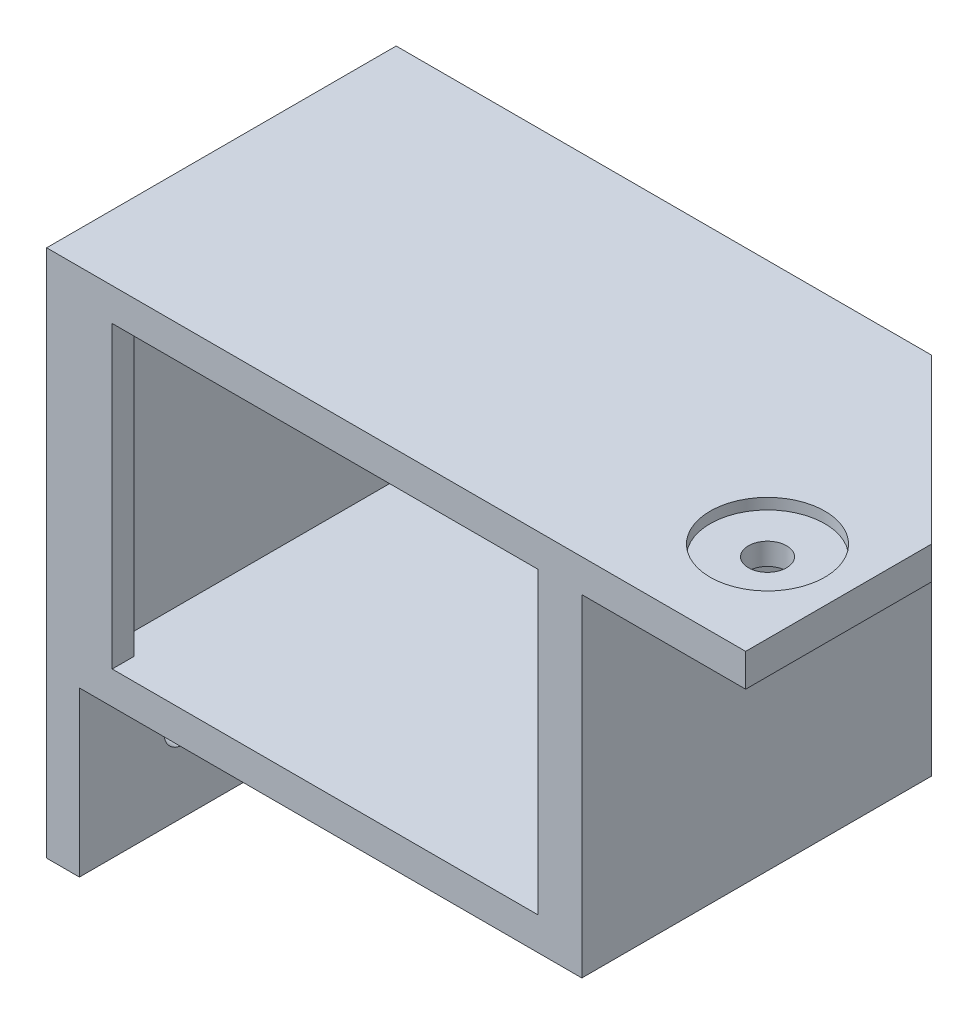
ISO-10303-21;
HEADER;
FILE_DESCRIPTION(('STEP AP214'),'2;1');
FILE_NAME('part.step','',(''),(''),'','','');
FILE_SCHEMA(('AUTOMOTIVE_DESIGN { 1 0 10303 214 1 1 1 1 }'));
ENDSEC;
DATA;
#1=APPLICATION_CONTEXT('core data for automotive mechanical design processes');
#2=APPLICATION_PROTOCOL_DEFINITION('international standard','automotive_design',2000,#1);
#3=PRODUCT_CONTEXT('',#1,'mechanical');
#4=PRODUCT('Part','Part','',(#3));
#5=PRODUCT_RELATED_PRODUCT_CATEGORY('part','',(#4));
#6=PRODUCT_DEFINITION_FORMATION('','',#4);
#7=PRODUCT_DEFINITION_CONTEXT('part definition',#1,'design');
#8=PRODUCT_DEFINITION('design','',#6,#7);
#9=PRODUCT_DEFINITION_SHAPE('','',#8);
#10=(LENGTH_UNIT() NAMED_UNIT(*) SI_UNIT(.MILLI.,.METRE.));
#11=(NAMED_UNIT(*) PLANE_ANGLE_UNIT() SI_UNIT($,.RADIAN.));
#12=(NAMED_UNIT(*) SI_UNIT($,.STERADIAN.) SOLID_ANGLE_UNIT());
#13=UNCERTAINTY_MEASURE_WITH_UNIT(LENGTH_MEASURE(1.E-05),#10,'distance_accuracy_value','');
#14=(GEOMETRIC_REPRESENTATION_CONTEXT(3) GLOBAL_UNCERTAINTY_ASSIGNED_CONTEXT((#13)) GLOBAL_UNIT_ASSIGNED_CONTEXT((#10,
#11,#12)) REPRESENTATION_CONTEXT('',''));
#15=CARTESIAN_POINT('',(0.,0.,0.));
#16=DIRECTION('',(0.,0.,1.));
#17=DIRECTION('',(1.,0.,0.));
#18=AXIS2_PLACEMENT_3D('',#15,#16,#17);
#19=CARTESIAN_POINT('',(-3.,-40.9000000000001,22.5));
#20=DIRECTION('',(1.,0.,0.));
#21=DIRECTION('',(0.,1.,0.));
#22=AXIS2_PLACEMENT_3D('',#19,#20,#21);
#23=CYLINDRICAL_SURFACE('',#22,1.75);
#24=CARTESIAN_POINT('',(3.,-40.9000000000001,22.5));
#25=DIRECTION('',(1.,0.,0.));
#26=DIRECTION('',(0.,1.,0.));
#27=AXIS2_PLACEMENT_3D('',#24,#25,#26);
#28=CIRCLE('',#27,1.75);
#29=CARTESIAN_POINT('',(3.,-39.1500000000001,22.5));
#30=VERTEX_POINT('',#29);
#31=EDGE_CURVE('E187',#30,#30,#28,.T.);
#32=ORIENTED_EDGE('',*,*,#31,.T.);
#33=EDGE_LOOP('',(#32));
#34=FACE_BOUND('',#33,.T.);
#35=CARTESIAN_POINT('',(1.,-40.9000000000001,22.5));
#36=DIRECTION('',(-1.,0.,0.));
#37=DIRECTION('',(0.,-1.,0.));
#38=AXIS2_PLACEMENT_3D('',#35,#36,#37);
#39=CIRCLE('',#38,1.75);
#40=CARTESIAN_POINT('',(1.,-42.6500000000001,22.5));
#41=VERTEX_POINT('',#40);
#42=EDGE_CURVE('E39',#41,#41,#39,.F.);
#43=ORIENTED_EDGE('',*,*,#42,.F.);
#44=EDGE_LOOP('',(#43));
#45=FACE_BOUND('',#44,.T.);
#46=ADVANCED_FACE('F35',(#34,#45),#23,.F.);
#47=CARTESIAN_POINT('',(56.5,2.99999999999996,22.5));
#48=DIRECTION('',(0.,-1.,0.));
#49=DIRECTION('',(1.,0.,0.));
#50=AXIS2_PLACEMENT_3D('',#47,#48,#49);
#51=CYLINDRICAL_SURFACE('',#50,1.75);
#52=CARTESIAN_POINT('',(56.5,-3.00000000000004,22.5));
#53=DIRECTION('',(0.,-1.,0.));
#54=DIRECTION('',(1.,0.,0.));
#55=AXIS2_PLACEMENT_3D('',#52,#53,#54);
#56=CIRCLE('',#55,1.75);
#57=CARTESIAN_POINT('',(58.25,-3.00000000000004,22.5));
#58=VERTEX_POINT('',#57);
#59=EDGE_CURVE('E183',#58,#58,#56,.T.);
#60=ORIENTED_EDGE('',*,*,#59,.T.);
#61=EDGE_LOOP('',(#60));
#62=FACE_BOUND('',#61,.T.);
#63=CARTESIAN_POINT('',(56.5,-1.,22.5));
#64=DIRECTION('',(0.,1.,0.));
#65=DIRECTION('',(0.,0.,1.));
#66=AXIS2_PLACEMENT_3D('',#63,#64,#65);
#67=CIRCLE('',#66,1.75);
#68=CARTESIAN_POINT('',(56.5,-1.,24.25));
#69=VERTEX_POINT('',#68);
#70=EDGE_CURVE('E290',#69,#69,#67,.F.);
#71=ORIENTED_EDGE('',*,*,#70,.F.);
#72=EDGE_LOOP('',(#71));
#73=FACE_BOUND('',#72,.T.);
#74=ADVANCED_FACE('F348',(#62,#73),#51,.F.);
#75=CARTESIAN_POINT('',(5.99999999999999,-3.00000000000005,32.));
#76=DIRECTION('',(1.,0.,0.));
#77=DIRECTION('',(0.,1.,0.));
#78=AXIS2_PLACEMENT_3D('',#75,#76,#77);
#79=PLANE('',#78);
#80=DIRECTION('',(0.,0.,-1.));
#81=VECTOR('',#80,1.);
#82=CARTESIAN_POINT('',(6.,-30.4,32.));
#83=LINE('',#82,#81);
#84=CARTESIAN_POINT('',(6.,-30.4,32.));
#85=VERTEX_POINT('',#84);
#86=CARTESIAN_POINT('',(6.,-30.4,30.));
#87=VERTEX_POINT('',#86);
#88=EDGE_CURVE('E225',#85,#87,#83,.T.);
#89=ORIENTED_EDGE('',*,*,#88,.T.);
#90=DIRECTION('',(0.,1.,0.));
#91=VECTOR('',#90,1.);
#92=CARTESIAN_POINT('',(5.99999999999999,-3.00000000000005,30.));
#93=LINE('',#92,#91);
#94=CARTESIAN_POINT('',(5.99999999999999,-3.00000000000005,30.));
#95=VERTEX_POINT('',#94);
#96=EDGE_CURVE('E168',#87,#95,#93,.T.);
#97=ORIENTED_EDGE('',*,*,#96,.T.);
#98=DIRECTION('',(0.,0.,-1.));
#99=VECTOR('',#98,1.);
#100=CARTESIAN_POINT('',(5.99999999999999,-3.00000000000005,32.));
#101=LINE('',#100,#99);
#102=CARTESIAN_POINT('',(5.99999999999999,-3.00000000000005,32.));
#103=VERTEX_POINT('',#102);
#104=EDGE_CURVE('E215',#103,#95,#101,.T.);
#105=ORIENTED_EDGE('',*,*,#104,.F.);
#106=DIRECTION('',(0.,-1.,0.));
#107=VECTOR('',#106,1.);
#108=CARTESIAN_POINT('',(5.99999999999999,-3.00000000000005,32.));
#109=LINE('',#108,#107);
#110=EDGE_CURVE('E207',#103,#85,#109,.T.);
#111=ORIENTED_EDGE('',*,*,#110,.T.);
#112=EDGE_LOOP('',(#89,#97,#105,#111));
#113=FACE_BOUND('',#112,.T.);
#114=ADVANCED_FACE('F325',(#113),#79,.T.);
#115=CARTESIAN_POINT('',(45.,-3.00000000000004,32.));
#116=DIRECTION('',(-1.,0.,0.));
#117=DIRECTION('',(0.,-1.,0.));
#118=AXIS2_PLACEMENT_3D('',#115,#116,#117);
#119=PLANE('',#118);
#120=DIRECTION('',(0.,0.,-1.));
#121=VECTOR('',#120,1.);
#122=CARTESIAN_POINT('',(45.,-3.00000000000004,32.));
#123=LINE('',#122,#121);
#124=CARTESIAN_POINT('',(45.,-3.00000000000004,32.));
#125=VERTEX_POINT('',#124);
#126=CARTESIAN_POINT('',(45.,-3.00000000000004,30.));
#127=VERTEX_POINT('',#126);
#128=EDGE_CURVE('E220',#125,#127,#123,.T.);
#129=ORIENTED_EDGE('',*,*,#128,.T.);
#130=DIRECTION('',(0.,-1.,0.));
#131=VECTOR('',#130,1.);
#132=CARTESIAN_POINT('',(45.,-3.00000000000004,30.));
#133=LINE('',#132,#131);
#134=CARTESIAN_POINT('',(45.,-30.4,30.));
#135=VERTEX_POINT('',#134);
#136=EDGE_CURVE('E202',#127,#135,#133,.T.);
#137=ORIENTED_EDGE('',*,*,#136,.T.);
#138=DIRECTION('',(0.,0.,-1.));
#139=VECTOR('',#138,1.);
#140=CARTESIAN_POINT('',(45.,-30.4,32.));
#141=LINE('',#140,#139);
#142=CARTESIAN_POINT('',(45.,-30.4,32.));
#143=VERTEX_POINT('',#142);
#144=EDGE_CURVE('E223',#143,#135,#141,.T.);
#145=ORIENTED_EDGE('',*,*,#144,.F.);
#146=DIRECTION('',(0.,1.,0.));
#147=VECTOR('',#146,1.);
#148=CARTESIAN_POINT('',(45.,-3.00000000000004,32.));
#149=LINE('',#148,#147);
#150=EDGE_CURVE('E211',#143,#125,#149,.T.);
#151=ORIENTED_EDGE('',*,*,#150,.T.);
#152=EDGE_LOOP('',(#129,#137,#145,#151));
#153=FACE_BOUND('',#152,.T.);
#154=ADVANCED_FACE('F333',(#153),#119,.T.);
#155=CARTESIAN_POINT('',(0.,0.,32.));
#156=DIRECTION('',(0.,0.,-1.));
#157=DIRECTION('',(-1.,0.,0.));
#158=AXIS2_PLACEMENT_3D('',#155,#156,#157);
#159=PLANE('',#158);
#160=DIRECTION('',(0.,-1.,0.));
#161=VECTOR('',#160,1.);
#162=CARTESIAN_POINT('',(0.,-48.4000000000001,32.));
#163=LINE('',#162,#161);
#164=CARTESIAN_POINT('',(0.,0.,32.));
#165=VERTEX_POINT('',#164);
#166=CARTESIAN_POINT('',(0.,-48.4000000000001,32.));
#167=VERTEX_POINT('',#166);
#168=EDGE_CURVE('E229',#165,#167,#163,.T.);
#169=ORIENTED_EDGE('',*,*,#168,.T.);
#170=DIRECTION('',(1.,0.,0.));
#171=VECTOR('',#170,1.);
#172=CARTESIAN_POINT('',(3.00000000000001,-48.4000000000001,32.));
#173=LINE('',#172,#171);
#174=CARTESIAN_POINT('',(3.00000000000001,-48.4000000000001,32.));
#175=VERTEX_POINT('',#174);
#176=EDGE_CURVE('E232',#167,#175,#173,.T.);
#177=ORIENTED_EDGE('',*,*,#176,.T.);
#178=DIRECTION('',(0.,1.,0.));
#179=VECTOR('',#178,1.);
#180=CARTESIAN_POINT('',(3.,-33.4000000000001,32.));
#181=LINE('',#180,#179);
#182=CARTESIAN_POINT('',(3.,-33.4000000000001,32.));
#183=VERTEX_POINT('',#182);
#184=EDGE_CURVE('E235',#175,#183,#181,.T.);
#185=ORIENTED_EDGE('',*,*,#184,.T.);
#186=DIRECTION('',(1.,0.,0.));
#187=VECTOR('',#186,1.);
#188=CARTESIAN_POINT('',(49.,-33.4,32.));
#189=LINE('',#188,#187);
#190=CARTESIAN_POINT('',(49.,-33.4,32.));
#191=VERTEX_POINT('',#190);
#192=EDGE_CURVE('E237',#183,#191,#189,.T.);
#193=ORIENTED_EDGE('',*,*,#192,.T.);
#194=DIRECTION('',(0.,1.,0.));
#195=VECTOR('',#194,1.);
#196=CARTESIAN_POINT('',(49.,-3.00000000000004,32.));
#197=LINE('',#196,#195);
#198=CARTESIAN_POINT('',(49.,-3.00000000000004,32.));
#199=VERTEX_POINT('',#198);
#200=EDGE_CURVE('E239',#191,#199,#197,.T.);
#201=ORIENTED_EDGE('',*,*,#200,.T.);
#202=DIRECTION('',(1.,0.,0.));
#203=VECTOR('',#202,1.);
#204=CARTESIAN_POINT('',(64.,-3.00000000000003,32.));
#205=LINE('',#204,#203);
#206=CARTESIAN_POINT('',(64.,-3.00000000000003,32.));
#207=VERTEX_POINT('',#206);
#208=EDGE_CURVE('E241',#199,#207,#205,.T.);
#209=ORIENTED_EDGE('',*,*,#208,.T.);
#210=DIRECTION('',(0.,1.,0.));
#211=VECTOR('',#210,1.);
#212=CARTESIAN_POINT('',(64.,0.,32.));
#213=LINE('',#212,#211);
#214=CARTESIAN_POINT('',(64.,0.,32.));
#215=VERTEX_POINT('',#214);
#216=EDGE_CURVE('E243',#207,#215,#213,.T.);
#217=ORIENTED_EDGE('',*,*,#216,.T.);
#218=DIRECTION('',(-1.,0.,0.));
#219=VECTOR('',#218,1.);
#220=CARTESIAN_POINT('',(0.,0.,32.));
#221=LINE('',#220,#219);
#222=EDGE_CURVE('E245',#215,#165,#221,.T.);
#223=ORIENTED_EDGE('',*,*,#222,.T.);
#224=EDGE_LOOP('',(#169,#177,#185,#193,#201,#209,#217,#223));
#225=FACE_BOUND('',#224,.T.);
#226=ORIENTED_EDGE('',*,*,#110,.F.);
#227=DIRECTION('',(-1.,0.,0.));
#228=VECTOR('',#227,1.);
#229=CARTESIAN_POINT('',(5.99999999999999,-3.00000000000005,32.));
#230=LINE('',#229,#228);
#231=EDGE_CURVE('E214',#125,#103,#230,.T.);
#232=ORIENTED_EDGE('',*,*,#231,.F.);
#233=ORIENTED_EDGE('',*,*,#150,.F.);
#234=DIRECTION('',(1.,0.,0.));
#235=VECTOR('',#234,1.);
#236=CARTESIAN_POINT('',(6.,-30.4,32.));
#237=LINE('',#236,#235);
#238=EDGE_CURVE('E209',#85,#143,#237,.T.);
#239=ORIENTED_EDGE('',*,*,#238,.F.);
#240=EDGE_LOOP('',(#226,#232,#233,#239));
#241=FACE_BOUND('',#240,.T.);
#242=ADVANCED_FACE('F329',(#225,#241),#159,.F.);
#243=CARTESIAN_POINT('',(0.,0.,0.));
#244=DIRECTION('',(0.,0.,-1.));
#245=DIRECTION('',(-1.,0.,0.));
#246=AXIS2_PLACEMENT_3D('',#243,#244,#245);
#247=PLANE('',#246);
#248=DIRECTION('',(0.,-1.,0.));
#249=VECTOR('',#248,1.);
#250=CARTESIAN_POINT('',(47.,-3.00000000000004,0.));
#251=LINE('',#250,#249);
#252=CARTESIAN_POINT('',(47.,-3.00000000000004,0.));
#253=VERTEX_POINT('',#252);
#254=CARTESIAN_POINT('',(47.,-30.4,0.));
#255=VERTEX_POINT('',#254);
#256=EDGE_CURVE('E161',#253,#255,#251,.T.);
#257=ORIENTED_EDGE('',*,*,#256,.F.);
#258=DIRECTION('',(-1.,0.,0.));
#259=VECTOR('',#258,1.);
#260=CARTESIAN_POINT('',(5.99999999999999,-3.00000000000005,0.));
#261=LINE('',#260,#259);
#262=CARTESIAN_POINT('',(4.,-3.00000000000004,0.));
#263=VERTEX_POINT('',#262);
#264=EDGE_CURVE('E167',#253,#263,#261,.T.);
#265=ORIENTED_EDGE('',*,*,#264,.T.);
#266=DIRECTION('',(0.,1.,0.));
#267=VECTOR('',#266,1.);
#268=CARTESIAN_POINT('',(4.,-3.00000000000004,0.));
#269=LINE('',#268,#267);
#270=CARTESIAN_POINT('',(4.,-30.4,0.));
#271=VERTEX_POINT('',#270);
#272=EDGE_CURVE('E163',#271,#263,#269,.T.);
#273=ORIENTED_EDGE('',*,*,#272,.F.);
#274=DIRECTION('',(1.,0.,0.));
#275=VECTOR('',#274,1.);
#276=CARTESIAN_POINT('',(6.,-30.4,0.));
#277=LINE('',#276,#275);
#278=EDGE_CURVE('E156',#271,#255,#277,.T.);
#279=ORIENTED_EDGE('',*,*,#278,.T.);
#280=EDGE_LOOP('',(#257,#265,#273,#279));
#281=FACE_BOUND('',#280,.T.);
#282=DIRECTION('',(1.,0.,0.));
#283=VECTOR('',#282,1.);
#284=CARTESIAN_POINT('',(49.,-33.4,0.));
#285=LINE('',#284,#283);
#286=CARTESIAN_POINT('',(3.,-33.4000000000001,0.));
#287=VERTEX_POINT('',#286);
#288=CARTESIAN_POINT('',(49.,-33.4,0.));
#289=VERTEX_POINT('',#288);
#290=EDGE_CURVE('E250',#287,#289,#285,.T.);
#291=ORIENTED_EDGE('',*,*,#290,.F.);
#292=DIRECTION('',(-1.,0.,0.));
#293=VECTOR('',#292,1.);
#294=CARTESIAN_POINT('',(0.,-33.4,0.));
#295=LINE('',#294,#293);
#296=CARTESIAN_POINT('',(0.,-33.4,0.));
#297=VERTEX_POINT('',#296);
#298=EDGE_CURVE('E284',#287,#297,#295,.T.);
#299=ORIENTED_EDGE('',*,*,#298,.T.);
#300=DIRECTION('',(0.,-1.,0.));
#301=VECTOR('',#300,1.);
#302=CARTESIAN_POINT('',(0.,-48.4000000000001,0.));
#303=LINE('',#302,#301);
#304=CARTESIAN_POINT('',(0.,0.,0.));
#305=VERTEX_POINT('',#304);
#306=EDGE_CURVE('E228',#305,#297,#303,.T.);
#307=ORIENTED_EDGE('',*,*,#306,.F.);
#308=DIRECTION('',(-1.,0.,0.));
#309=VECTOR('',#308,1.);
#310=CARTESIAN_POINT('',(0.,0.,0.));
#311=LINE('',#310,#309);
#312=CARTESIAN_POINT('',(48.9999999999999,0.,0.));
#313=VERTEX_POINT('',#312);
#314=EDGE_CURVE('E233',#313,#305,#311,.T.);
#315=ORIENTED_EDGE('',*,*,#314,.F.);
#316=DIRECTION('',(0.,-1.,0.));
#317=VECTOR('',#316,1.);
#318=CARTESIAN_POINT('',(48.9999999999999,-3.00000000000003,0.));
#319=LINE('',#318,#317);
#320=CARTESIAN_POINT('',(49.,-3.00000000000004,0.));
#321=VERTEX_POINT('',#320);
#322=EDGE_CURVE('E282',#313,#321,#319,.T.);
#323=ORIENTED_EDGE('',*,*,#322,.T.);
#324=DIRECTION('',(0.,1.,0.));
#325=VECTOR('',#324,1.);
#326=CARTESIAN_POINT('',(49.,-3.00000000000004,0.));
#327=LINE('',#326,#325);
#328=EDGE_CURVE('E252',#289,#321,#327,.T.);
#329=ORIENTED_EDGE('',*,*,#328,.F.);
#330=EDGE_LOOP('',(#291,#299,#307,#315,#323,#329));
#331=FACE_BOUND('',#330,.T.);
#332=ADVANCED_FACE('F158',(#281,#331),#247,.T.);
#333=CARTESIAN_POINT('',(0.,-48.4000000000001,32.));
#334=DIRECTION('',(1.,0.,0.));
#335=DIRECTION('',(0.,1.,0.));
#336=AXIS2_PLACEMENT_3D('',#333,#334,#335);
#337=PLANE('',#336);
#338=CARTESIAN_POINT('',(0.,-40.9000000000001,22.5));
#339=DIRECTION('',(-1.,0.,0.));
#340=DIRECTION('',(0.,-1.,0.));
#341=AXIS2_PLACEMENT_3D('',#338,#339,#340);
#342=CIRCLE('',#341,5.25);
#343=CARTESIAN_POINT('',(0.,-46.1500000000001,22.5));
#344=VERTEX_POINT('',#343);
#345=EDGE_CURVE('E305',#344,#344,#342,.T.);
#346=ORIENTED_EDGE('',*,*,#345,.F.);
#347=EDGE_LOOP('',(#346));
#348=FACE_BOUND('',#347,.T.);
#349=ORIENTED_EDGE('',*,*,#306,.T.);
#350=DIRECTION('',(0.,-0.707106781186548,0.707106781186547));
#351=VECTOR('',#350,1.);
#352=CARTESIAN_POINT('',(0.,-48.4000000000001,15.));
#353=LINE('',#352,#351);
#354=CARTESIAN_POINT('',(0.,-48.4000000000001,15.));
#355=VERTEX_POINT('',#354);
#356=EDGE_CURVE('E286',#297,#355,#353,.T.);
#357=ORIENTED_EDGE('',*,*,#356,.T.);
#358=DIRECTION('',(0.,0.,-1.));
#359=VECTOR('',#358,1.);
#360=CARTESIAN_POINT('',(0.,-48.4000000000001,32.));
#361=LINE('',#360,#359);
#362=EDGE_CURVE('E274',#167,#355,#361,.T.);
#363=ORIENTED_EDGE('',*,*,#362,.F.);
#364=ORIENTED_EDGE('',*,*,#168,.F.);
#365=DIRECTION('',(0.,0.,-1.));
#366=VECTOR('',#365,1.);
#367=CARTESIAN_POINT('',(0.,0.,32.));
#368=LINE('',#367,#366);
#369=EDGE_CURVE('E247',#165,#305,#368,.T.);
#370=ORIENTED_EDGE('',*,*,#369,.T.);
#371=EDGE_LOOP('',(#349,#357,#363,#364,#370));
#372=FACE_BOUND('',#371,.T.);
#373=ADVANCED_FACE('F383',(#348,#372),#337,.F.);
#374=CARTESIAN_POINT('',(3.00000000000001,-48.4000000000001,32.));
#375=DIRECTION('',(0.,1.,0.));
#376=DIRECTION('',(0.,0.,1.));
#377=AXIS2_PLACEMENT_3D('',#374,#375,#376);
#378=PLANE('',#377);
#379=ORIENTED_EDGE('',*,*,#362,.T.);
#380=DIRECTION('',(1.,0.,0.));
#381=VECTOR('',#380,1.);
#382=CARTESIAN_POINT('',(3.00000000000001,-48.4000000000001,15.));
#383=LINE('',#382,#381);
#384=CARTESIAN_POINT('',(3.00000000000001,-48.4000000000001,15.));
#385=VERTEX_POINT('',#384);
#386=EDGE_CURVE('E277',#355,#385,#383,.T.);
#387=ORIENTED_EDGE('',*,*,#386,.T.);
#388=DIRECTION('',(0.,0.,-1.));
#389=VECTOR('',#388,1.);
#390=CARTESIAN_POINT('',(3.00000000000001,-48.4000000000001,32.));
#391=LINE('',#390,#389);
#392=EDGE_CURVE('E271',#175,#385,#391,.T.);
#393=ORIENTED_EDGE('',*,*,#392,.F.);
#394=ORIENTED_EDGE('',*,*,#176,.F.);
#395=EDGE_LOOP('',(#379,#387,#393,#394));
#396=FACE_BOUND('',#395,.T.);
#397=ADVANCED_FACE('F386',(#396),#378,.F.);
#398=CARTESIAN_POINT('',(3.,-33.4000000000001,32.));
#399=DIRECTION('',(-1.,0.,0.));
#400=DIRECTION('',(0.,-1.,0.));
#401=AXIS2_PLACEMENT_3D('',#398,#399,#400);
#402=PLANE('',#401);
#403=ORIENTED_EDGE('',*,*,#31,.F.);
#404=EDGE_LOOP('',(#403));
#405=FACE_BOUND('',#404,.T.);
#406=ORIENTED_EDGE('',*,*,#392,.T.);
#407=DIRECTION('',(0.,0.707106781186548,-0.707106781186547));
#408=VECTOR('',#407,1.);
#409=CARTESIAN_POINT('',(3.00000000000001,-48.4000000000001,15.));
#410=LINE('',#409,#408);
#411=EDGE_CURVE('E280',#385,#287,#410,.T.);
#412=ORIENTED_EDGE('',*,*,#411,.T.);
#413=DIRECTION('',(0.,0.,-1.));
#414=VECTOR('',#413,1.);
#415=CARTESIAN_POINT('',(3.,-33.4000000000001,32.));
#416=LINE('',#415,#414);
#417=EDGE_CURVE('E268',#183,#287,#416,.T.);
#418=ORIENTED_EDGE('',*,*,#417,.F.);
#419=ORIENTED_EDGE('',*,*,#184,.F.);
#420=EDGE_LOOP('',(#406,#412,#418,#419));
#421=FACE_BOUND('',#420,.T.);
#422=ADVANCED_FACE('F402',(#405,#421),#402,.F.);
#423=CARTESIAN_POINT('',(49.,-33.4,32.));
#424=DIRECTION('',(0.,1.,0.));
#425=DIRECTION('',(-1.,0.,0.));
#426=AXIS2_PLACEMENT_3D('',#423,#424,#425);
#427=PLANE('',#426);
#428=ORIENTED_EDGE('',*,*,#290,.T.);
#429=DIRECTION('',(0.,0.,-1.));
#430=VECTOR('',#429,1.);
#431=CARTESIAN_POINT('',(49.,-33.4,32.));
#432=LINE('',#431,#430);
#433=EDGE_CURVE('E265',#191,#289,#432,.T.);
#434=ORIENTED_EDGE('',*,*,#433,.F.);
#435=ORIENTED_EDGE('',*,*,#192,.F.);
#436=ORIENTED_EDGE('',*,*,#417,.T.);
#437=EDGE_LOOP('',(#428,#434,#435,#436));
#438=FACE_BOUND('',#437,.T.);
#439=ADVANCED_FACE('F423',(#438),#427,.F.);
#440=CARTESIAN_POINT('',(49.,-3.00000000000004,32.));
#441=DIRECTION('',(-1.,0.,0.));
#442=DIRECTION('',(0.,-1.,0.));
#443=AXIS2_PLACEMENT_3D('',#440,#441,#442);
#444=PLANE('',#443);
#445=ORIENTED_EDGE('',*,*,#328,.T.);
#446=DIRECTION('',(0.,0.,-1.));
#447=VECTOR('',#446,1.);
#448=CARTESIAN_POINT('',(49.,-3.00000000000004,32.));
#449=LINE('',#448,#447);
#450=EDGE_CURVE('E263',#199,#321,#449,.T.);
#451=ORIENTED_EDGE('',*,*,#450,.F.);
#452=ORIENTED_EDGE('',*,*,#200,.F.);
#453=ORIENTED_EDGE('',*,*,#433,.T.);
#454=EDGE_LOOP('',(#445,#451,#452,#453));
#455=FACE_BOUND('',#454,.T.);
#456=ADVANCED_FACE('F421',(#455),#444,.F.);
#457=CARTESIAN_POINT('',(64.,-3.00000000000003,32.));
#458=DIRECTION('',(0.,1.,0.));
#459=DIRECTION('',(-1.,0.,0.));
#460=AXIS2_PLACEMENT_3D('',#457,#458,#459);
#461=PLANE('',#460);
#462=ORIENTED_EDGE('',*,*,#59,.F.);
#463=EDGE_LOOP('',(#462));
#464=FACE_BOUND('',#463,.T.);
#465=ORIENTED_EDGE('',*,*,#450,.T.);
#466=DIRECTION('',(0.707106781186548,0.,0.707106781186548));
#467=VECTOR('',#466,1.);
#468=CARTESIAN_POINT('',(64.,-3.00000000000003,15.));
#469=LINE('',#468,#467);
#470=CARTESIAN_POINT('',(64.,-3.00000000000003,15.));
#471=VERTEX_POINT('',#470);
#472=EDGE_CURVE('E12',#321,#471,#469,.T.);
#473=ORIENTED_EDGE('',*,*,#472,.T.);
#474=DIRECTION('',(0.,0.,-1.));
#475=VECTOR('',#474,1.);
#476=CARTESIAN_POINT('',(64.,-3.00000000000003,32.));
#477=LINE('',#476,#475);
#478=EDGE_CURVE('E261',#207,#471,#477,.T.);
#479=ORIENTED_EDGE('',*,*,#478,.F.);
#480=ORIENTED_EDGE('',*,*,#208,.F.);
#481=EDGE_LOOP('',(#465,#473,#479,#480));
#482=FACE_BOUND('',#481,.T.);
#483=ADVANCED_FACE('F417',(#464,#482),#461,.F.);
#484=CARTESIAN_POINT('',(64.,0.,32.));
#485=DIRECTION('',(-1.,0.,0.));
#486=DIRECTION('',(0.,0.,1.));
#487=AXIS2_PLACEMENT_3D('',#484,#485,#486);
#488=PLANE('',#487);
#489=ORIENTED_EDGE('',*,*,#478,.T.);
#490=DIRECTION('',(0.,1.,0.));
#491=VECTOR('',#490,1.);
#492=CARTESIAN_POINT('',(64.,0.,15.));
#493=LINE('',#492,#491);
#494=CARTESIAN_POINT('',(64.,0.,15.));
#495=VERTEX_POINT('',#494);
#496=EDGE_CURVE('E288',#471,#495,#493,.T.);
#497=ORIENTED_EDGE('',*,*,#496,.T.);
#498=DIRECTION('',(0.,0.,-1.));
#499=VECTOR('',#498,1.);
#500=CARTESIAN_POINT('',(64.,0.,32.));
#501=LINE('',#500,#499);
#502=EDGE_CURVE('E258',#215,#495,#501,.T.);
#503=ORIENTED_EDGE('',*,*,#502,.F.);
#504=ORIENTED_EDGE('',*,*,#216,.F.);
#505=EDGE_LOOP('',(#489,#497,#503,#504));
#506=FACE_BOUND('',#505,.T.);
#507=ADVANCED_FACE('F415',(#506),#488,.F.);
#508=CARTESIAN_POINT('',(0.,0.,32.));
#509=DIRECTION('',(0.,-1.,0.));
#510=DIRECTION('',(0.,0.,-1.));
#511=AXIS2_PLACEMENT_3D('',#508,#509,#510);
#512=PLANE('',#511);
#513=CARTESIAN_POINT('',(56.5,0.,22.5));
#514=DIRECTION('',(0.,1.,0.));
#515=DIRECTION('',(0.,0.,1.));
#516=AXIS2_PLACEMENT_3D('',#513,#514,#515);
#517=CIRCLE('',#516,5.25);
#518=CARTESIAN_POINT('',(56.5,0.,27.75));
#519=VERTEX_POINT('',#518);
#520=EDGE_CURVE('E298',#519,#519,#517,.T.);
#521=ORIENTED_EDGE('',*,*,#520,.F.);
#522=EDGE_LOOP('',(#521));
#523=FACE_BOUND('',#522,.T.);
#524=ORIENTED_EDGE('',*,*,#502,.T.);
#525=DIRECTION('',(-0.707106781186548,0.,-0.707106781186548));
#526=VECTOR('',#525,1.);
#527=CARTESIAN_POINT('',(64.,0.,15.));
#528=LINE('',#527,#526);
#529=EDGE_CURVE('E44',#495,#313,#528,.T.);
#530=ORIENTED_EDGE('',*,*,#529,.T.);
#531=ORIENTED_EDGE('',*,*,#314,.T.);
#532=ORIENTED_EDGE('',*,*,#369,.F.);
#533=ORIENTED_EDGE('',*,*,#222,.F.);
#534=EDGE_LOOP('',(#524,#530,#531,#532,#533));
#535=FACE_BOUND('',#534,.T.);
#536=ADVANCED_FACE('F411',(#523,#535),#512,.F.);
#537=CARTESIAN_POINT('',(6.,-30.4,32.));
#538=DIRECTION('',(0.,1.,0.));
#539=DIRECTION('',(-1.,0.,0.));
#540=AXIS2_PLACEMENT_3D('',#537,#538,#539);
#541=PLANE('',#540);
#542=ORIENTED_EDGE('',*,*,#278,.F.);
#543=DIRECTION('',(0.,0.,-1.));
#544=VECTOR('',#543,1.);
#545=CARTESIAN_POINT('',(4.,-30.4,82.9878416879946));
#546=LINE('',#545,#544);
#547=CARTESIAN_POINT('',(4.,-30.4,30.));
#548=VERTEX_POINT('',#547);
#549=EDGE_CURVE('E177',#548,#271,#546,.T.);
#550=ORIENTED_EDGE('',*,*,#549,.F.);
#551=DIRECTION('',(1.,0.,0.));
#552=VECTOR('',#551,1.);
#553=CARTESIAN_POINT('',(47.,-30.4,30.));
#554=LINE('',#553,#552);
#555=EDGE_CURVE('E199',#548,#87,#554,.T.);
#556=ORIENTED_EDGE('',*,*,#555,.T.);
#557=ORIENTED_EDGE('',*,*,#88,.F.);
#558=ORIENTED_EDGE('',*,*,#238,.T.);
#559=ORIENTED_EDGE('',*,*,#144,.T.);
#560=CARTESIAN_POINT('',(47.,-30.4,30.));
#561=VERTEX_POINT('',#560);
#562=EDGE_CURVE('E174',#135,#561,#554,.T.);
#563=ORIENTED_EDGE('',*,*,#562,.T.);
#564=DIRECTION('',(0.,0.,-1.));
#565=VECTOR('',#564,1.);
#566=CARTESIAN_POINT('',(47.,-30.4,82.9878416879946));
#567=LINE('',#566,#565);
#568=EDGE_CURVE('E171',#561,#255,#567,.T.);
#569=ORIENTED_EDGE('',*,*,#568,.T.);
#570=EDGE_LOOP('',(#542,#550,#556,#557,#558,#559,#563,#569));
#571=FACE_BOUND('',#570,.T.);
#572=ADVANCED_FACE('F172',(#571),#541,.T.);
#573=CARTESIAN_POINT('',(5.99999999999999,-3.00000000000005,32.));
#574=DIRECTION('',(0.,-1.,0.));
#575=DIRECTION('',(1.,0.,0.));
#576=AXIS2_PLACEMENT_3D('',#573,#574,#575);
#577=PLANE('',#576);
#578=ORIENTED_EDGE('',*,*,#264,.F.);
#579=DIRECTION('',(0.,0.,-1.));
#580=VECTOR('',#579,1.);
#581=CARTESIAN_POINT('',(47.,-3.00000000000004,82.9878416879946));
#582=LINE('',#581,#580);
#583=CARTESIAN_POINT('',(47.,-3.00000000000004,30.));
#584=VERTEX_POINT('',#583);
#585=EDGE_CURVE('E182',#584,#253,#582,.T.);
#586=ORIENTED_EDGE('',*,*,#585,.F.);
#587=DIRECTION('',(-1.,0.,0.));
#588=VECTOR('',#587,1.);
#589=CARTESIAN_POINT('',(47.,-3.00000000000004,30.));
#590=LINE('',#589,#588);
#591=EDGE_CURVE('E309',#584,#127,#590,.T.);
#592=ORIENTED_EDGE('',*,*,#591,.T.);
#593=ORIENTED_EDGE('',*,*,#128,.F.);
#594=ORIENTED_EDGE('',*,*,#231,.T.);
#595=ORIENTED_EDGE('',*,*,#104,.T.);
#596=CARTESIAN_POINT('',(4.,-3.00000000000004,30.));
#597=VERTEX_POINT('',#596);
#598=EDGE_CURVE('E308',#95,#597,#590,.T.);
#599=ORIENTED_EDGE('',*,*,#598,.T.);
#600=DIRECTION('',(0.,0.,-1.));
#601=VECTOR('',#600,1.);
#602=CARTESIAN_POINT('',(4.,-3.00000000000004,82.9878416879946));
#603=LINE('',#602,#601);
#604=EDGE_CURVE('E195',#597,#263,#603,.T.);
#605=ORIENTED_EDGE('',*,*,#604,.T.);
#606=EDGE_LOOP('',(#578,#586,#592,#593,#594,#595,#599,#605));
#607=FACE_BOUND('',#606,.T.);
#608=ADVANCED_FACE('F314',(#607),#577,.T.);
#609=CARTESIAN_POINT('',(0.,0.,30.));
#610=DIRECTION('',(0.,0.,-1.));
#611=DIRECTION('',(-1.,0.,0.));
#612=AXIS2_PLACEMENT_3D('',#609,#610,#611);
#613=PLANE('',#612);
#614=ORIENTED_EDGE('',*,*,#591,.F.);
#615=DIRECTION('',(0.,1.,0.));
#616=VECTOR('',#615,1.);
#617=CARTESIAN_POINT('',(47.,-3.00000000000004,30.));
#618=LINE('',#617,#616);
#619=EDGE_CURVE('E190',#561,#584,#618,.T.);
#620=ORIENTED_EDGE('',*,*,#619,.F.);
#621=ORIENTED_EDGE('',*,*,#562,.F.);
#622=ORIENTED_EDGE('',*,*,#136,.F.);
#623=EDGE_LOOP('',(#614,#620,#621,#622));
#624=FACE_BOUND('',#623,.T.);
#625=ADVANCED_FACE('F335',(#624),#613,.T.);
#626=CARTESIAN_POINT('',(47.,-3.00000000000004,82.9878416879946));
#627=DIRECTION('',(1.,0.,0.));
#628=DIRECTION('',(0.,0.,-1.));
#629=AXIS2_PLACEMENT_3D('',#626,#627,#628);
#630=PLANE('',#629);
#631=ORIENTED_EDGE('',*,*,#619,.T.);
#632=ORIENTED_EDGE('',*,*,#585,.T.);
#633=ORIENTED_EDGE('',*,*,#256,.T.);
#634=ORIENTED_EDGE('',*,*,#568,.F.);
#635=EDGE_LOOP('',(#631,#632,#633,#634));
#636=FACE_BOUND('',#635,.T.);
#637=ADVANCED_FACE('F180',(#636),#630,.F.);
#638=ORIENTED_EDGE('',*,*,#555,.F.);
#639=DIRECTION('',(0.,-1.,0.));
#640=VECTOR('',#639,1.);
#641=CARTESIAN_POINT('',(4.,-3.00000000000004,30.));
#642=LINE('',#641,#640);
#643=EDGE_CURVE('E194',#597,#548,#642,.T.);
#644=ORIENTED_EDGE('',*,*,#643,.F.);
#645=ORIENTED_EDGE('',*,*,#598,.F.);
#646=ORIENTED_EDGE('',*,*,#96,.F.);
#647=EDGE_LOOP('',(#638,#644,#645,#646));
#648=FACE_BOUND('',#647,.T.);
#649=ADVANCED_FACE('F319',(#648),#613,.T.);
#650=CARTESIAN_POINT('',(4.,-3.00000000000004,82.9878416879946));
#651=DIRECTION('',(-1.,0.,0.));
#652=DIRECTION('',(0.,0.,1.));
#653=AXIS2_PLACEMENT_3D('',#650,#651,#652);
#654=PLANE('',#653);
#655=ORIENTED_EDGE('',*,*,#643,.T.);
#656=ORIENTED_EDGE('',*,*,#549,.T.);
#657=ORIENTED_EDGE('',*,*,#272,.T.);
#658=ORIENTED_EDGE('',*,*,#604,.F.);
#659=EDGE_LOOP('',(#655,#656,#657,#658));
#660=FACE_BOUND('',#659,.T.);
#661=ADVANCED_FACE('F321',(#660),#654,.F.);
#662=CARTESIAN_POINT('',(3.00000000000001,-48.4000000000001,15.));
#663=DIRECTION('',(0.,-0.707106781186547,-0.707106781186548));
#664=DIRECTION('',(-1.,0.,0.));
#665=AXIS2_PLACEMENT_3D('',#662,#663,#664);
#666=PLANE('',#665);
#667=ORIENTED_EDGE('',*,*,#356,.F.);
#668=ORIENTED_EDGE('',*,*,#298,.F.);
#669=ORIENTED_EDGE('',*,*,#411,.F.);
#670=ORIENTED_EDGE('',*,*,#386,.F.);
#671=EDGE_LOOP('',(#667,#668,#669,#670));
#672=FACE_BOUND('',#671,.T.);
#673=ADVANCED_FACE('F397',(#672),#666,.T.);
#674=CARTESIAN_POINT('',(64.,0.,15.));
#675=DIRECTION('',(0.707106781186547,0.,-0.707106781186547));
#676=DIRECTION('',(0.,-1.,0.));
#677=AXIS2_PLACEMENT_3D('',#674,#675,#676);
#678=PLANE('',#677);
#679=ORIENTED_EDGE('',*,*,#472,.F.);
#680=ORIENTED_EDGE('',*,*,#322,.F.);
#681=ORIENTED_EDGE('',*,*,#529,.F.);
#682=ORIENTED_EDGE('',*,*,#496,.F.);
#683=EDGE_LOOP('',(#679,#680,#681,#682));
#684=FACE_BOUND('',#683,.T.);
#685=ADVANCED_FACE('F37',(#684),#678,.T.);
#686=CARTESIAN_POINT('',(56.5,-1.,22.5));
#687=DIRECTION('',(0.,1.,0.));
#688=DIRECTION('',(0.,0.,1.));
#689=AXIS2_PLACEMENT_3D('',#686,#687,#688);
#690=PLANE('',#689);
#691=CARTESIAN_POINT('',(56.5,-1.,22.5));
#692=DIRECTION('',(0.,1.,0.));
#693=DIRECTION('',(0.,0.,1.));
#694=AXIS2_PLACEMENT_3D('',#691,#692,#693);
#695=CIRCLE('',#694,5.25);
#696=CARTESIAN_POINT('',(56.5,-1.,27.75));
#697=VERTEX_POINT('',#696);
#698=EDGE_CURVE('E292',#697,#697,#695,.T.);
#699=ORIENTED_EDGE('',*,*,#698,.T.);
#700=EDGE_LOOP('',(#699));
#701=FACE_BOUND('',#700,.T.);
#702=ORIENTED_EDGE('',*,*,#70,.T.);
#703=EDGE_LOOP('',(#702));
#704=FACE_BOUND('',#703,.T.);
#705=ADVANCED_FACE('F361',(#701,#704),#690,.T.);
#706=CARTESIAN_POINT('',(56.5,-1.,22.5));
#707=DIRECTION('',(0.,1.,0.));
#708=DIRECTION('',(0.,0.,1.));
#709=AXIS2_PLACEMENT_3D('',#706,#707,#708);
#710=CYLINDRICAL_SURFACE('',#709,5.25);
#711=ORIENTED_EDGE('',*,*,#698,.F.);
#712=EDGE_LOOP('',(#711));
#713=FACE_BOUND('',#712,.T.);
#714=ORIENTED_EDGE('',*,*,#520,.T.);
#715=EDGE_LOOP('',(#714));
#716=FACE_BOUND('',#715,.T.);
#717=ADVANCED_FACE('F357',(#713,#716),#710,.F.);
#718=CARTESIAN_POINT('',(1.,-40.9000000000001,22.5));
#719=DIRECTION('',(-1.,0.,0.));
#720=DIRECTION('',(0.,-1.,0.));
#721=AXIS2_PLACEMENT_3D('',#718,#719,#720);
#722=PLANE('',#721);
#723=CARTESIAN_POINT('',(1.,-40.9000000000001,22.5));
#724=DIRECTION('',(-1.,0.,0.));
#725=DIRECTION('',(0.,-1.,0.));
#726=AXIS2_PLACEMENT_3D('',#723,#724,#725);
#727=CIRCLE('',#726,5.25);
#728=CARTESIAN_POINT('',(1.00000000000001,-46.1500000000001,22.5));
#729=VERTEX_POINT('',#728);
#730=EDGE_CURVE('E376',#729,#729,#727,.T.);
#731=ORIENTED_EDGE('',*,*,#730,.T.);
#732=EDGE_LOOP('',(#731));
#733=FACE_BOUND('',#732,.T.);
#734=ORIENTED_EDGE('',*,*,#42,.T.);
#735=EDGE_LOOP('',(#734));
#736=FACE_BOUND('',#735,.T.);
#737=ADVANCED_FACE('F360',(#733,#736),#722,.T.);
#738=CARTESIAN_POINT('',(1.,-40.9000000000001,22.5));
#739=DIRECTION('',(-1.,0.,0.));
#740=DIRECTION('',(0.,-1.,0.));
#741=AXIS2_PLACEMENT_3D('',#738,#739,#740);
#742=CYLINDRICAL_SURFACE('',#741,5.25);
#743=ORIENTED_EDGE('',*,*,#730,.F.);
#744=EDGE_LOOP('',(#743));
#745=FACE_BOUND('',#744,.T.);
#746=ORIENTED_EDGE('',*,*,#345,.T.);
#747=EDGE_LOOP('',(#746));
#748=FACE_BOUND('',#747,.T.);
#749=ADVANCED_FACE('F365',(#745,#748),#742,.F.);
#750=CLOSED_SHELL('',(#46,#74,#114,#154,#242,#332,#373,#397,#422,#439,#456,#483,#507,#536,#572,
#608,#625,#637,#649,#661,#673,#685,#705,#717,#737,#749));
#751=MANIFOLD_SOLID_BREP('B2',#750);
#752=ADVANCED_BREP_SHAPE_REPRESENTATION('',(#18,#751),#14);
#753=SHAPE_DEFINITION_REPRESENTATION(#9,#752);
ENDSEC;
END-ISO-10303-21;
